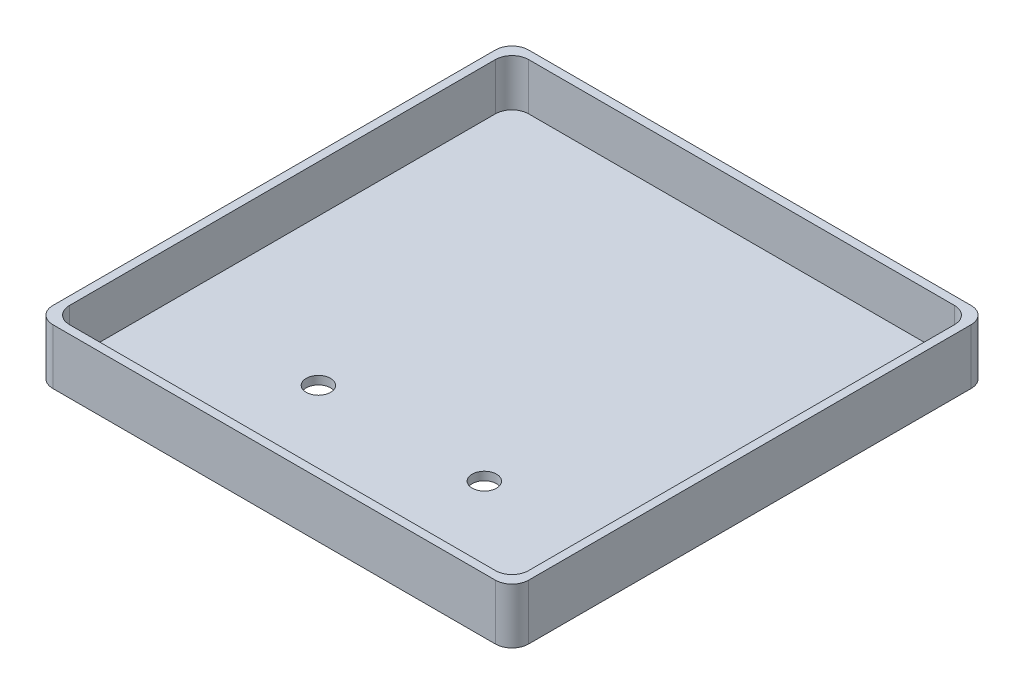
ISO-10303-21;
HEADER;
FILE_DESCRIPTION(('STEP AP214'),'2;1');
FILE_NAME('part.step','',(''),(''),'','','');
FILE_SCHEMA(('AUTOMOTIVE_DESIGN { 1 0 10303 214 1 1 1 1 }'));
ENDSEC;
DATA;
#1=APPLICATION_CONTEXT('core data for automotive mechanical design processes');
#2=APPLICATION_PROTOCOL_DEFINITION('international standard','automotive_design',2000,#1);
#3=PRODUCT_CONTEXT('',#1,'mechanical');
#4=PRODUCT('Part','Part','',(#3));
#5=PRODUCT_RELATED_PRODUCT_CATEGORY('part','',(#4));
#6=PRODUCT_DEFINITION_FORMATION('','',#4);
#7=PRODUCT_DEFINITION_CONTEXT('part definition',#1,'design');
#8=PRODUCT_DEFINITION('design','',#6,#7);
#9=PRODUCT_DEFINITION_SHAPE('','',#8);
#10=(LENGTH_UNIT() NAMED_UNIT(*) SI_UNIT(.MILLI.,.METRE.));
#11=(NAMED_UNIT(*) PLANE_ANGLE_UNIT() SI_UNIT($,.RADIAN.));
#12=(NAMED_UNIT(*) SI_UNIT($,.STERADIAN.) SOLID_ANGLE_UNIT());
#13=UNCERTAINTY_MEASURE_WITH_UNIT(LENGTH_MEASURE(1.E-05),#10,'distance_accuracy_value','');
#14=(GEOMETRIC_REPRESENTATION_CONTEXT(3) GLOBAL_UNCERTAINTY_ASSIGNED_CONTEXT((#13)) GLOBAL_UNIT_ASSIGNED_CONTEXT((#10,
#11,#12)) REPRESENTATION_CONTEXT('',''));
#15=CARTESIAN_POINT('',(0.,0.,0.));
#16=DIRECTION('',(0.,0.,1.));
#17=DIRECTION('',(1.,0.,0.));
#18=AXIS2_PLACEMENT_3D('',#15,#16,#17);
#19=CARTESIAN_POINT('',(-40.,10.,40.));
#20=DIRECTION('',(0.,-1.,0.));
#21=DIRECTION('',(0.,0.,-1.));
#22=AXIS2_PLACEMENT_3D('',#19,#20,#21);
#23=CYLINDRICAL_SURFACE('',#22,3.);
#24=CARTESIAN_POINT('',(-40.,0.,40.));
#25=DIRECTION('',(0.,1.,0.));
#26=DIRECTION('',(0.,0.,1.));
#27=AXIS2_PLACEMENT_3D('',#24,#25,#26);
#28=CIRCLE('',#27,3.);
#29=CARTESIAN_POINT('',(-43.,0.,40.));
#30=VERTEX_POINT('',#29);
#31=CARTESIAN_POINT('',(-40.,0.,43.));
#32=VERTEX_POINT('',#31);
#33=EDGE_CURVE('E153',#30,#32,#28,.T.);
#34=ORIENTED_EDGE('',*,*,#33,.T.);
#35=DIRECTION('',(0.,-1.,0.));
#36=VECTOR('',#35,1.);
#37=CARTESIAN_POINT('',(-40.,10.,43.));
#38=LINE('',#37,#36);
#39=CARTESIAN_POINT('',(-40.,10.,43.));
#40=VERTEX_POINT('',#39);
#41=EDGE_CURVE('E11',#40,#32,#38,.T.);
#42=ORIENTED_EDGE('',*,*,#41,.F.);
#43=CARTESIAN_POINT('',(-40.,10.,40.));
#44=DIRECTION('',(0.,1.,0.));
#45=DIRECTION('',(0.,0.,1.));
#46=AXIS2_PLACEMENT_3D('',#43,#44,#45);
#47=CIRCLE('',#46,3.);
#48=CARTESIAN_POINT('',(-43.,10.,40.));
#49=VERTEX_POINT('',#48);
#50=EDGE_CURVE('E177',#49,#40,#47,.T.);
#51=ORIENTED_EDGE('',*,*,#50,.F.);
#52=DIRECTION('',(0.,-1.,0.));
#53=VECTOR('',#52,1.);
#54=CARTESIAN_POINT('',(-43.,10.,40.));
#55=LINE('',#54,#53);
#56=EDGE_CURVE('E149',#49,#30,#55,.T.);
#57=ORIENTED_EDGE('',*,*,#56,.T.);
#58=EDGE_LOOP('',(#34,#42,#51,#57));
#59=FACE_BOUND('',#58,.T.);
#60=ADVANCED_FACE('F38',(#59),#23,.T.);
#61=CARTESIAN_POINT('',(-40.,10.,43.));
#62=DIRECTION('',(0.,0.,-1.));
#63=DIRECTION('',(-1.,0.,0.));
#64=AXIS2_PLACEMENT_3D('',#61,#62,#63);
#65=PLANE('',#64);
#66=DIRECTION('',(1.,0.,0.));
#67=VECTOR('',#66,1.);
#68=CARTESIAN_POINT('',(-40.,0.,43.));
#69=LINE('',#68,#67);
#70=CARTESIAN_POINT('',(40.,0.,43.));
#71=VERTEX_POINT('',#70);
#72=EDGE_CURVE('E157',#32,#71,#69,.T.);
#73=ORIENTED_EDGE('',*,*,#72,.T.);
#74=DIRECTION('',(0.,-1.,0.));
#75=VECTOR('',#74,1.);
#76=CARTESIAN_POINT('',(40.,10.,43.));
#77=LINE('',#76,#75);
#78=CARTESIAN_POINT('',(40.,10.,43.));
#79=VERTEX_POINT('',#78);
#80=EDGE_CURVE('E47',#79,#71,#77,.T.);
#81=ORIENTED_EDGE('',*,*,#80,.F.);
#82=DIRECTION('',(1.,0.,0.));
#83=VECTOR('',#82,1.);
#84=CARTESIAN_POINT('',(-40.,10.,43.));
#85=LINE('',#84,#83);
#86=EDGE_CURVE('E105',#40,#79,#85,.T.);
#87=ORIENTED_EDGE('',*,*,#86,.F.);
#88=ORIENTED_EDGE('',*,*,#41,.T.);
#89=EDGE_LOOP('',(#73,#81,#87,#88));
#90=FACE_BOUND('',#89,.T.);
#91=ADVANCED_FACE('F330',(#90),#65,.F.);
#92=CARTESIAN_POINT('',(40.,10.,40.));
#93=DIRECTION('',(0.,-1.,0.));
#94=DIRECTION('',(0.,0.,-1.));
#95=AXIS2_PLACEMENT_3D('',#92,#93,#94);
#96=CYLINDRICAL_SURFACE('',#95,3.);
#97=CARTESIAN_POINT('',(40.,0.,40.));
#98=DIRECTION('',(0.,1.,0.));
#99=DIRECTION('',(0.,0.,1.));
#100=AXIS2_PLACEMENT_3D('',#97,#98,#99);
#101=CIRCLE('',#100,3.);
#102=CARTESIAN_POINT('',(43.,0.,40.));
#103=VERTEX_POINT('',#102);
#104=EDGE_CURVE('E161',#71,#103,#101,.T.);
#105=ORIENTED_EDGE('',*,*,#104,.T.);
#106=DIRECTION('',(0.,-1.,0.));
#107=VECTOR('',#106,1.);
#108=CARTESIAN_POINT('',(43.,10.,40.));
#109=LINE('',#108,#107);
#110=CARTESIAN_POINT('',(43.,10.,40.));
#111=VERTEX_POINT('',#110);
#112=EDGE_CURVE('E188',#111,#103,#109,.T.);
#113=ORIENTED_EDGE('',*,*,#112,.F.);
#114=CARTESIAN_POINT('',(40.,10.,40.));
#115=DIRECTION('',(0.,1.,0.));
#116=DIRECTION('',(0.,0.,1.));
#117=AXIS2_PLACEMENT_3D('',#114,#115,#116);
#118=CIRCLE('',#117,3.);
#119=EDGE_CURVE('E307',#79,#111,#118,.T.);
#120=ORIENTED_EDGE('',*,*,#119,.F.);
#121=ORIENTED_EDGE('',*,*,#80,.T.);
#122=EDGE_LOOP('',(#105,#113,#120,#121));
#123=FACE_BOUND('',#122,.T.);
#124=ADVANCED_FACE('F333',(#123),#96,.T.);
#125=CARTESIAN_POINT('',(43.,10.,-40.));
#126=DIRECTION('',(-1.,0.,0.));
#127=DIRECTION('',(0.,0.,1.));
#128=AXIS2_PLACEMENT_3D('',#125,#126,#127);
#129=PLANE('',#128);
#130=DIRECTION('',(0.,0.,-1.));
#131=VECTOR('',#130,1.);
#132=CARTESIAN_POINT('',(43.,0.,-40.));
#133=LINE('',#132,#131);
#134=CARTESIAN_POINT('',(43.,0.,-40.));
#135=VERTEX_POINT('',#134);
#136=EDGE_CURVE('E164',#103,#135,#133,.T.);
#137=ORIENTED_EDGE('',*,*,#136,.T.);
#138=DIRECTION('',(0.,-1.,0.));
#139=VECTOR('',#138,1.);
#140=CARTESIAN_POINT('',(43.,10.,-40.));
#141=LINE('',#140,#139);
#142=CARTESIAN_POINT('',(43.,10.,-40.));
#143=VERTEX_POINT('',#142);
#144=EDGE_CURVE('E184',#143,#135,#141,.T.);
#145=ORIENTED_EDGE('',*,*,#144,.F.);
#146=DIRECTION('',(0.,0.,-1.));
#147=VECTOR('',#146,1.);
#148=CARTESIAN_POINT('',(43.,10.,-40.));
#149=LINE('',#148,#147);
#150=EDGE_CURVE('E310',#111,#143,#149,.T.);
#151=ORIENTED_EDGE('',*,*,#150,.F.);
#152=ORIENTED_EDGE('',*,*,#112,.T.);
#153=EDGE_LOOP('',(#137,#145,#151,#152));
#154=FACE_BOUND('',#153,.T.);
#155=ADVANCED_FACE('F318',(#154),#129,.F.);
#156=CARTESIAN_POINT('',(40.,10.,-40.));
#157=DIRECTION('',(0.,-1.,0.));
#158=DIRECTION('',(0.,0.,-1.));
#159=AXIS2_PLACEMENT_3D('',#156,#157,#158);
#160=CYLINDRICAL_SURFACE('',#159,3.);
#161=CARTESIAN_POINT('',(40.,0.,-40.));
#162=DIRECTION('',(0.,1.,0.));
#163=DIRECTION('',(0.,0.,-1.));
#164=AXIS2_PLACEMENT_3D('',#161,#162,#163);
#165=CIRCLE('',#164,3.);
#166=CARTESIAN_POINT('',(40.,0.,-43.));
#167=VERTEX_POINT('',#166);
#168=EDGE_CURVE('E167',#135,#167,#165,.T.);
#169=ORIENTED_EDGE('',*,*,#168,.T.);
#170=DIRECTION('',(0.,-1.,0.));
#171=VECTOR('',#170,1.);
#172=CARTESIAN_POINT('',(40.,10.,-43.));
#173=LINE('',#172,#171);
#174=CARTESIAN_POINT('',(40.,10.,-43.));
#175=VERTEX_POINT('',#174);
#176=EDGE_CURVE('E142',#175,#167,#173,.T.);
#177=ORIENTED_EDGE('',*,*,#176,.F.);
#178=CARTESIAN_POINT('',(40.,10.,-40.));
#179=DIRECTION('',(0.,1.,0.));
#180=DIRECTION('',(0.,0.,-1.));
#181=AXIS2_PLACEMENT_3D('',#178,#179,#180);
#182=CIRCLE('',#181,3.);
#183=EDGE_CURVE('E128',#143,#175,#182,.T.);
#184=ORIENTED_EDGE('',*,*,#183,.F.);
#185=ORIENTED_EDGE('',*,*,#144,.T.);
#186=EDGE_LOOP('',(#169,#177,#184,#185));
#187=FACE_BOUND('',#186,.T.);
#188=ADVANCED_FACE('F322',(#187),#160,.T.);
#189=CARTESIAN_POINT('',(-40.,10.,-43.));
#190=DIRECTION('',(0.,0.,1.));
#191=DIRECTION('',(1.,0.,0.));
#192=AXIS2_PLACEMENT_3D('',#189,#190,#191);
#193=PLANE('',#192);
#194=DIRECTION('',(-1.,0.,0.));
#195=VECTOR('',#194,1.);
#196=CARTESIAN_POINT('',(-40.,0.,-43.));
#197=LINE('',#196,#195);
#198=CARTESIAN_POINT('',(-40.,0.,-43.));
#199=VERTEX_POINT('',#198);
#200=EDGE_CURVE('E138',#167,#199,#197,.T.);
#201=ORIENTED_EDGE('',*,*,#200,.T.);
#202=DIRECTION('',(0.,-1.,0.));
#203=VECTOR('',#202,1.);
#204=CARTESIAN_POINT('',(-40.,10.,-43.));
#205=LINE('',#204,#203);
#206=CARTESIAN_POINT('',(-40.,10.,-43.));
#207=VERTEX_POINT('',#206);
#208=EDGE_CURVE('E135',#207,#199,#205,.T.);
#209=ORIENTED_EDGE('',*,*,#208,.F.);
#210=DIRECTION('',(-1.,0.,0.));
#211=VECTOR('',#210,1.);
#212=CARTESIAN_POINT('',(-40.,10.,-43.));
#213=LINE('',#212,#211);
#214=EDGE_CURVE('E121',#175,#207,#213,.T.);
#215=ORIENTED_EDGE('',*,*,#214,.F.);
#216=ORIENTED_EDGE('',*,*,#176,.T.);
#217=EDGE_LOOP('',(#201,#209,#215,#216));
#218=FACE_BOUND('',#217,.T.);
#219=ADVANCED_FACE('F136',(#218),#193,.F.);
#220=CARTESIAN_POINT('',(-40.,10.,-40.));
#221=DIRECTION('',(0.,-1.,0.));
#222=DIRECTION('',(0.,0.,-1.));
#223=AXIS2_PLACEMENT_3D('',#220,#221,#222);
#224=CYLINDRICAL_SURFACE('',#223,3.);
#225=CARTESIAN_POINT('',(-40.,0.,-40.));
#226=DIRECTION('',(0.,1.,0.));
#227=DIRECTION('',(0.,0.,1.));
#228=AXIS2_PLACEMENT_3D('',#225,#226,#227);
#229=CIRCLE('',#228,3.);
#230=CARTESIAN_POINT('',(-43.,0.,-40.));
#231=VERTEX_POINT('',#230);
#232=EDGE_CURVE('E172',#199,#231,#229,.T.);
#233=ORIENTED_EDGE('',*,*,#232,.T.);
#234=DIRECTION('',(0.,-1.,0.));
#235=VECTOR('',#234,1.);
#236=CARTESIAN_POINT('',(-43.,10.,-40.));
#237=LINE('',#236,#235);
#238=CARTESIAN_POINT('',(-43.,10.,-40.));
#239=VERTEX_POINT('',#238);
#240=EDGE_CURVE('E143',#239,#231,#237,.T.);
#241=ORIENTED_EDGE('',*,*,#240,.F.);
#242=CARTESIAN_POINT('',(-40.,10.,-40.));
#243=DIRECTION('',(0.,1.,0.));
#244=DIRECTION('',(0.,0.,1.));
#245=AXIS2_PLACEMENT_3D('',#242,#243,#244);
#246=CIRCLE('',#245,3.);
#247=EDGE_CURVE('E125',#207,#239,#246,.T.);
#248=ORIENTED_EDGE('',*,*,#247,.F.);
#249=ORIENTED_EDGE('',*,*,#208,.T.);
#250=EDGE_LOOP('',(#233,#241,#248,#249));
#251=FACE_BOUND('',#250,.T.);
#252=ADVANCED_FACE('F145',(#251),#224,.T.);
#253=CARTESIAN_POINT('',(-43.,10.,-40.));
#254=DIRECTION('',(1.,0.,0.));
#255=DIRECTION('',(0.,0.,-1.));
#256=AXIS2_PLACEMENT_3D('',#253,#254,#255);
#257=PLANE('',#256);
#258=DIRECTION('',(0.,0.,1.));
#259=VECTOR('',#258,1.);
#260=CARTESIAN_POINT('',(-43.,0.,-40.));
#261=LINE('',#260,#259);
#262=EDGE_CURVE('E97',#231,#30,#261,.T.);
#263=ORIENTED_EDGE('',*,*,#262,.T.);
#264=ORIENTED_EDGE('',*,*,#56,.F.);
#265=DIRECTION('',(0.,0.,1.));
#266=VECTOR('',#265,1.);
#267=CARTESIAN_POINT('',(-43.,10.,-40.));
#268=LINE('',#267,#266);
#269=EDGE_CURVE('E64',#239,#49,#268,.T.);
#270=ORIENTED_EDGE('',*,*,#269,.F.);
#271=ORIENTED_EDGE('',*,*,#240,.T.);
#272=EDGE_LOOP('',(#263,#264,#270,#271));
#273=FACE_BOUND('',#272,.T.);
#274=ADVANCED_FACE('F326',(#273),#257,.F.);
#275=CARTESIAN_POINT('',(-40.,10.,40.));
#276=DIRECTION('',(0.,1.,0.));
#277=DIRECTION('',(0.,0.,1.));
#278=AXIS2_PLACEMENT_3D('',#275,#276,#277);
#279=PLANE('',#278);
#280=CARTESIAN_POINT('',(-38.5,10.,38.5));
#281=DIRECTION('',(0.,1.,0.));
#282=DIRECTION('',(0.,0.,-1.));
#283=AXIS2_PLACEMENT_3D('',#280,#281,#282);
#284=CIRCLE('',#283,3.);
#285=CARTESIAN_POINT('',(-41.5,10.,38.5));
#286=VERTEX_POINT('',#285);
#287=CARTESIAN_POINT('',(-38.5,10.,41.5));
#288=VERTEX_POINT('',#287);
#289=EDGE_CURVE('E55',#286,#288,#284,.T.);
#290=ORIENTED_EDGE('',*,*,#289,.F.);
#291=DIRECTION('',(0.,0.,1.));
#292=VECTOR('',#291,1.);
#293=CARTESIAN_POINT('',(-41.5,10.,38.5));
#294=LINE('',#293,#292);
#295=CARTESIAN_POINT('',(-41.5,10.,-38.5));
#296=VERTEX_POINT('',#295);
#297=EDGE_CURVE('E217',#296,#286,#294,.T.);
#298=ORIENTED_EDGE('',*,*,#297,.F.);
#299=CARTESIAN_POINT('',(-38.5,10.,-38.5));
#300=DIRECTION('',(0.,1.,0.));
#301=DIRECTION('',(0.,0.,-1.));
#302=AXIS2_PLACEMENT_3D('',#299,#300,#301);
#303=CIRCLE('',#302,3.);
#304=CARTESIAN_POINT('',(-38.5,10.,-41.5));
#305=VERTEX_POINT('',#304);
#306=EDGE_CURVE('E268',#305,#296,#303,.T.);
#307=ORIENTED_EDGE('',*,*,#306,.F.);
#308=DIRECTION('',(-1.,0.,0.));
#309=VECTOR('',#308,1.);
#310=CARTESIAN_POINT('',(-38.5,10.,-41.5));
#311=LINE('',#310,#309);
#312=CARTESIAN_POINT('',(38.5,10.,-41.5));
#313=VERTEX_POINT('',#312);
#314=EDGE_CURVE('E264',#313,#305,#311,.T.);
#315=ORIENTED_EDGE('',*,*,#314,.F.);
#316=CARTESIAN_POINT('',(38.5,10.,-38.5));
#317=DIRECTION('',(0.,1.,0.));
#318=DIRECTION('',(0.,0.,-1.));
#319=AXIS2_PLACEMENT_3D('',#316,#317,#318);
#320=CIRCLE('',#319,3.);
#321=CARTESIAN_POINT('',(41.5,10.,-38.5));
#322=VERTEX_POINT('',#321);
#323=EDGE_CURVE('E260',#322,#313,#320,.T.);
#324=ORIENTED_EDGE('',*,*,#323,.F.);
#325=DIRECTION('',(0.,0.,-1.));
#326=VECTOR('',#325,1.);
#327=CARTESIAN_POINT('',(41.5,10.,38.5));
#328=LINE('',#327,#326);
#329=CARTESIAN_POINT('',(41.5,10.,38.5));
#330=VERTEX_POINT('',#329);
#331=EDGE_CURVE('E256',#330,#322,#328,.T.);
#332=ORIENTED_EDGE('',*,*,#331,.F.);
#333=CARTESIAN_POINT('',(38.5,10.,38.5));
#334=DIRECTION('',(0.,1.,0.));
#335=DIRECTION('',(0.,0.,1.));
#336=AXIS2_PLACEMENT_3D('',#333,#334,#335);
#337=CIRCLE('',#336,3.);
#338=CARTESIAN_POINT('',(38.5,10.,41.5));
#339=VERTEX_POINT('',#338);
#340=EDGE_CURVE('E252',#339,#330,#337,.T.);
#341=ORIENTED_EDGE('',*,*,#340,.F.);
#342=DIRECTION('',(1.,0.,0.));
#343=VECTOR('',#342,1.);
#344=CARTESIAN_POINT('',(-38.5,10.,41.5));
#345=LINE('',#344,#343);
#346=EDGE_CURVE('E248',#288,#339,#345,.T.);
#347=ORIENTED_EDGE('',*,*,#346,.F.);
#348=EDGE_LOOP('',(#290,#298,#307,#315,#324,#332,#341,#347));
#349=FACE_BOUND('',#348,.T.);
#350=ORIENTED_EDGE('',*,*,#50,.T.);
#351=ORIENTED_EDGE('',*,*,#86,.T.);
#352=ORIENTED_EDGE('',*,*,#119,.T.);
#353=ORIENTED_EDGE('',*,*,#150,.T.);
#354=ORIENTED_EDGE('',*,*,#183,.T.);
#355=ORIENTED_EDGE('',*,*,#214,.T.);
#356=ORIENTED_EDGE('',*,*,#247,.T.);
#357=ORIENTED_EDGE('',*,*,#269,.T.);
#358=EDGE_LOOP('',(#350,#351,#352,#353,#354,#355,#356,#357));
#359=FACE_BOUND('',#358,.T.);
#360=ADVANCED_FACE('F123',(#349,#359),#279,.T.);
#361=CARTESIAN_POINT('',(-40.,0.,40.));
#362=DIRECTION('',(0.,1.,0.));
#363=DIRECTION('',(0.,0.,1.));
#364=AXIS2_PLACEMENT_3D('',#361,#362,#363);
#365=PLANE('',#364);
#366=CARTESIAN_POINT('',(-15.,0.,20.));
#367=DIRECTION('',(0.,-1.,0.));
#368=DIRECTION('',(0.,0.,-1.));
#369=AXIS2_PLACEMENT_3D('',#366,#367,#368);
#370=CIRCLE('',#369,2.2);
#371=CARTESIAN_POINT('',(-15.,0.,17.8));
#372=VERTEX_POINT('',#371);
#373=EDGE_CURVE('E197',#372,#372,#370,.T.);
#374=ORIENTED_EDGE('',*,*,#373,.F.);
#375=EDGE_LOOP('',(#374));
#376=FACE_BOUND('',#375,.T.);
#377=CARTESIAN_POINT('',(15.,0.,20.));
#378=DIRECTION('',(0.,-1.,0.));
#379=DIRECTION('',(0.,0.,1.));
#380=AXIS2_PLACEMENT_3D('',#377,#378,#379);
#381=CIRCLE('',#380,2.2);
#382=CARTESIAN_POINT('',(15.,0.,22.2));
#383=VERTEX_POINT('',#382);
#384=EDGE_CURVE('E204',#383,#383,#381,.T.);
#385=ORIENTED_EDGE('',*,*,#384,.F.);
#386=EDGE_LOOP('',(#385));
#387=FACE_BOUND('',#386,.T.);
#388=ORIENTED_EDGE('',*,*,#33,.F.);
#389=ORIENTED_EDGE('',*,*,#262,.F.);
#390=ORIENTED_EDGE('',*,*,#232,.F.);
#391=ORIENTED_EDGE('',*,*,#200,.F.);
#392=ORIENTED_EDGE('',*,*,#168,.F.);
#393=ORIENTED_EDGE('',*,*,#136,.F.);
#394=ORIENTED_EDGE('',*,*,#104,.F.);
#395=ORIENTED_EDGE('',*,*,#72,.F.);
#396=EDGE_LOOP('',(#388,#389,#390,#391,#392,#393,#394,#395));
#397=FACE_BOUND('',#396,.T.);
#398=ADVANCED_FACE('F325',(#376,#387,#397),#365,.F.);
#399=CARTESIAN_POINT('',(-38.5,1.5,38.5));
#400=DIRECTION('',(0.,1.,0.));
#401=DIRECTION('',(0.,0.,1.));
#402=AXIS2_PLACEMENT_3D('',#399,#400,#401);
#403=CYLINDRICAL_SURFACE('',#402,3.);
#404=ORIENTED_EDGE('',*,*,#289,.T.);
#405=DIRECTION('',(0.,1.,0.));
#406=VECTOR('',#405,1.);
#407=CARTESIAN_POINT('',(-38.5,1.5,41.5));
#408=LINE('',#407,#406);
#409=CARTESIAN_POINT('',(-38.5,1.5,41.5));
#410=VERTEX_POINT('',#409);
#411=EDGE_CURVE('E245',#410,#288,#408,.T.);
#412=ORIENTED_EDGE('',*,*,#411,.F.);
#413=CARTESIAN_POINT('',(-38.5,1.5,38.5));
#414=DIRECTION('',(0.,1.,0.));
#415=DIRECTION('',(0.,0.,-1.));
#416=AXIS2_PLACEMENT_3D('',#413,#414,#415);
#417=CIRCLE('',#416,3.);
#418=CARTESIAN_POINT('',(-41.5,1.5,38.5));
#419=VERTEX_POINT('',#418);
#420=EDGE_CURVE('E212',#419,#410,#417,.T.);
#421=ORIENTED_EDGE('',*,*,#420,.F.);
#422=DIRECTION('',(0.,1.,0.));
#423=VECTOR('',#422,1.);
#424=CARTESIAN_POINT('',(-41.5,1.5,38.5));
#425=LINE('',#424,#423);
#426=EDGE_CURVE('E158',#419,#286,#425,.T.);
#427=ORIENTED_EDGE('',*,*,#426,.T.);
#428=EDGE_LOOP('',(#404,#412,#421,#427));
#429=FACE_BOUND('',#428,.T.);
#430=ADVANCED_FACE('F406',(#429),#403,.F.);
#431=CARTESIAN_POINT('',(-41.5,1.5,38.5));
#432=DIRECTION('',(-1.,0.,0.));
#433=DIRECTION('',(0.,0.,1.));
#434=AXIS2_PLACEMENT_3D('',#431,#432,#433);
#435=PLANE('',#434);
#436=ORIENTED_EDGE('',*,*,#297,.T.);
#437=ORIENTED_EDGE('',*,*,#426,.F.);
#438=DIRECTION('',(0.,0.,1.));
#439=VECTOR('',#438,1.);
#440=CARTESIAN_POINT('',(-41.5,1.5,38.5));
#441=LINE('',#440,#439);
#442=CARTESIAN_POINT('',(-41.5,1.5,-38.5));
#443=VERTEX_POINT('',#442);
#444=EDGE_CURVE('E241',#443,#419,#441,.T.);
#445=ORIENTED_EDGE('',*,*,#444,.F.);
#446=DIRECTION('',(0.,1.,0.));
#447=VECTOR('',#446,1.);
#448=CARTESIAN_POINT('',(-41.5,1.5,-38.5));
#449=LINE('',#448,#447);
#450=EDGE_CURVE('E277',#443,#296,#449,.T.);
#451=ORIENTED_EDGE('',*,*,#450,.T.);
#452=EDGE_LOOP('',(#436,#437,#445,#451));
#453=FACE_BOUND('',#452,.T.);
#454=ADVANCED_FACE('F411',(#453),#435,.F.);
#455=CARTESIAN_POINT('',(-38.5,1.5,-38.5));
#456=DIRECTION('',(0.,1.,0.));
#457=DIRECTION('',(0.,0.,1.));
#458=AXIS2_PLACEMENT_3D('',#455,#456,#457);
#459=CYLINDRICAL_SURFACE('',#458,3.);
#460=ORIENTED_EDGE('',*,*,#306,.T.);
#461=ORIENTED_EDGE('',*,*,#450,.F.);
#462=CARTESIAN_POINT('',(-38.5,1.5,-38.5));
#463=DIRECTION('',(0.,1.,0.));
#464=DIRECTION('',(0.,0.,-1.));
#465=AXIS2_PLACEMENT_3D('',#462,#463,#464);
#466=CIRCLE('',#465,3.);
#467=CARTESIAN_POINT('',(-38.5,1.5,-41.5));
#468=VERTEX_POINT('',#467);
#469=EDGE_CURVE('E237',#468,#443,#466,.T.);
#470=ORIENTED_EDGE('',*,*,#469,.F.);
#471=DIRECTION('',(0.,1.,0.));
#472=VECTOR('',#471,1.);
#473=CARTESIAN_POINT('',(-38.5,1.5,-41.5));
#474=LINE('',#473,#472);
#475=EDGE_CURVE('E281',#468,#305,#474,.T.);
#476=ORIENTED_EDGE('',*,*,#475,.T.);
#477=EDGE_LOOP('',(#460,#461,#470,#476));
#478=FACE_BOUND('',#477,.T.);
#479=ADVANCED_FACE('F420',(#478),#459,.F.);
#480=CARTESIAN_POINT('',(-38.5,1.5,-41.5));
#481=DIRECTION('',(0.,0.,-1.));
#482=DIRECTION('',(-1.,0.,0.));
#483=AXIS2_PLACEMENT_3D('',#480,#481,#482);
#484=PLANE('',#483);
#485=ORIENTED_EDGE('',*,*,#314,.T.);
#486=ORIENTED_EDGE('',*,*,#475,.F.);
#487=DIRECTION('',(-1.,0.,0.));
#488=VECTOR('',#487,1.);
#489=CARTESIAN_POINT('',(-38.5,1.5,-41.5));
#490=LINE('',#489,#488);
#491=CARTESIAN_POINT('',(38.5,1.5,-41.5));
#492=VERTEX_POINT('',#491);
#493=EDGE_CURVE('E233',#492,#468,#490,.T.);
#494=ORIENTED_EDGE('',*,*,#493,.F.);
#495=DIRECTION('',(0.,1.,0.));
#496=VECTOR('',#495,1.);
#497=CARTESIAN_POINT('',(38.5,1.5,-41.5));
#498=LINE('',#497,#496);
#499=EDGE_CURVE('E285',#492,#313,#498,.T.);
#500=ORIENTED_EDGE('',*,*,#499,.T.);
#501=EDGE_LOOP('',(#485,#486,#494,#500));
#502=FACE_BOUND('',#501,.T.);
#503=ADVANCED_FACE('F430',(#502),#484,.F.);
#504=CARTESIAN_POINT('',(38.5,1.5,-38.5));
#505=DIRECTION('',(0.,1.,0.));
#506=DIRECTION('',(0.,0.,1.));
#507=AXIS2_PLACEMENT_3D('',#504,#505,#506);
#508=CYLINDRICAL_SURFACE('',#507,3.);
#509=ORIENTED_EDGE('',*,*,#323,.T.);
#510=ORIENTED_EDGE('',*,*,#499,.F.);
#511=CARTESIAN_POINT('',(38.5,1.5,-38.5));
#512=DIRECTION('',(0.,1.,0.));
#513=DIRECTION('',(0.,0.,-1.));
#514=AXIS2_PLACEMENT_3D('',#511,#512,#513);
#515=CIRCLE('',#514,3.);
#516=CARTESIAN_POINT('',(41.5,1.5,-38.5));
#517=VERTEX_POINT('',#516);
#518=EDGE_CURVE('E229',#517,#492,#515,.T.);
#519=ORIENTED_EDGE('',*,*,#518,.F.);
#520=DIRECTION('',(0.,1.,0.));
#521=VECTOR('',#520,1.);
#522=CARTESIAN_POINT('',(41.5,1.5,-38.5));
#523=LINE('',#522,#521);
#524=EDGE_CURVE('E289',#517,#322,#523,.T.);
#525=ORIENTED_EDGE('',*,*,#524,.T.);
#526=EDGE_LOOP('',(#509,#510,#519,#525));
#527=FACE_BOUND('',#526,.T.);
#528=ADVANCED_FACE('F440',(#527),#508,.F.);
#529=CARTESIAN_POINT('',(41.5,1.5,38.5));
#530=DIRECTION('',(1.,0.,0.));
#531=DIRECTION('',(0.,0.,-1.));
#532=AXIS2_PLACEMENT_3D('',#529,#530,#531);
#533=PLANE('',#532);
#534=ORIENTED_EDGE('',*,*,#331,.T.);
#535=ORIENTED_EDGE('',*,*,#524,.F.);
#536=DIRECTION('',(0.,0.,-1.));
#537=VECTOR('',#536,1.);
#538=CARTESIAN_POINT('',(41.5,1.5,38.5));
#539=LINE('',#538,#537);
#540=CARTESIAN_POINT('',(41.5,1.5,38.5));
#541=VERTEX_POINT('',#540);
#542=EDGE_CURVE('E225',#541,#517,#539,.T.);
#543=ORIENTED_EDGE('',*,*,#542,.F.);
#544=DIRECTION('',(0.,1.,0.));
#545=VECTOR('',#544,1.);
#546=CARTESIAN_POINT('',(41.5,1.5,38.5));
#547=LINE('',#546,#545);
#548=EDGE_CURVE('E293',#541,#330,#547,.T.);
#549=ORIENTED_EDGE('',*,*,#548,.T.);
#550=EDGE_LOOP('',(#534,#535,#543,#549));
#551=FACE_BOUND('',#550,.T.);
#552=ADVANCED_FACE('F450',(#551),#533,.F.);
#553=CARTESIAN_POINT('',(38.5,1.5,38.5));
#554=DIRECTION('',(0.,1.,0.));
#555=DIRECTION('',(0.,0.,1.));
#556=AXIS2_PLACEMENT_3D('',#553,#554,#555);
#557=CYLINDRICAL_SURFACE('',#556,3.);
#558=ORIENTED_EDGE('',*,*,#340,.T.);
#559=ORIENTED_EDGE('',*,*,#548,.F.);
#560=CARTESIAN_POINT('',(38.5,1.5,38.5));
#561=DIRECTION('',(0.,1.,0.));
#562=DIRECTION('',(0.,0.,1.));
#563=AXIS2_PLACEMENT_3D('',#560,#561,#562);
#564=CIRCLE('',#563,3.);
#565=CARTESIAN_POINT('',(38.5,1.5,41.5));
#566=VERTEX_POINT('',#565);
#567=EDGE_CURVE('E221',#566,#541,#564,.T.);
#568=ORIENTED_EDGE('',*,*,#567,.F.);
#569=DIRECTION('',(0.,1.,0.));
#570=VECTOR('',#569,1.);
#571=CARTESIAN_POINT('',(38.5,1.5,41.5));
#572=LINE('',#571,#570);
#573=EDGE_CURVE('E297',#566,#339,#572,.T.);
#574=ORIENTED_EDGE('',*,*,#573,.T.);
#575=EDGE_LOOP('',(#558,#559,#568,#574));
#576=FACE_BOUND('',#575,.T.);
#577=ADVANCED_FACE('F460',(#576),#557,.F.);
#578=CARTESIAN_POINT('',(-38.5,1.5,41.5));
#579=DIRECTION('',(0.,0.,1.));
#580=DIRECTION('',(1.,0.,0.));
#581=AXIS2_PLACEMENT_3D('',#578,#579,#580);
#582=PLANE('',#581);
#583=ORIENTED_EDGE('',*,*,#346,.T.);
#584=ORIENTED_EDGE('',*,*,#573,.F.);
#585=DIRECTION('',(1.,0.,0.));
#586=VECTOR('',#585,1.);
#587=CARTESIAN_POINT('',(-38.5,1.5,41.5));
#588=LINE('',#587,#586);
#589=EDGE_CURVE('E216',#410,#566,#588,.T.);
#590=ORIENTED_EDGE('',*,*,#589,.F.);
#591=ORIENTED_EDGE('',*,*,#411,.T.);
#592=EDGE_LOOP('',(#583,#584,#590,#591));
#593=FACE_BOUND('',#592,.T.);
#594=ADVANCED_FACE('F470',(#593),#582,.F.);
#595=CARTESIAN_POINT('',(-38.5,1.5,38.5));
#596=DIRECTION('',(0.,-1.,0.));
#597=DIRECTION('',(0.,0.,-1.));
#598=AXIS2_PLACEMENT_3D('',#595,#596,#597);
#599=PLANE('',#598);
#600=CARTESIAN_POINT('',(-15.,1.5,20.));
#601=DIRECTION('',(0.,-1.,0.));
#602=DIRECTION('',(0.,0.,-1.));
#603=AXIS2_PLACEMENT_3D('',#600,#601,#602);
#604=CIRCLE('',#603,2.2);
#605=CARTESIAN_POINT('',(-15.,1.5,17.8));
#606=VERTEX_POINT('',#605);
#607=EDGE_CURVE('E41',#606,#606,#604,.T.);
#608=ORIENTED_EDGE('',*,*,#607,.T.);
#609=EDGE_LOOP('',(#608));
#610=FACE_BOUND('',#609,.T.);
#611=CARTESIAN_POINT('',(15.,1.5,20.));
#612=DIRECTION('',(0.,-1.,0.));
#613=DIRECTION('',(0.,0.,-1.));
#614=AXIS2_PLACEMENT_3D('',#611,#612,#613);
#615=CIRCLE('',#614,2.2);
#616=CARTESIAN_POINT('',(15.,1.5,17.8));
#617=VERTEX_POINT('',#616);
#618=EDGE_CURVE('E194',#617,#617,#615,.T.);
#619=ORIENTED_EDGE('',*,*,#618,.T.);
#620=EDGE_LOOP('',(#619));
#621=FACE_BOUND('',#620,.T.);
#622=ORIENTED_EDGE('',*,*,#420,.T.);
#623=ORIENTED_EDGE('',*,*,#589,.T.);
#624=ORIENTED_EDGE('',*,*,#567,.T.);
#625=ORIENTED_EDGE('',*,*,#542,.T.);
#626=ORIENTED_EDGE('',*,*,#518,.T.);
#627=ORIENTED_EDGE('',*,*,#493,.T.);
#628=ORIENTED_EDGE('',*,*,#469,.T.);
#629=ORIENTED_EDGE('',*,*,#444,.T.);
#630=EDGE_LOOP('',(#622,#623,#624,#625,#626,#627,#628,#629));
#631=FACE_BOUND('',#630,.T.);
#632=ADVANCED_FACE('F480',(#610,#621,#631),#599,.F.);
#633=CARTESIAN_POINT('',(15.,10.,20.));
#634=DIRECTION('',(0.,-1.,0.));
#635=DIRECTION('',(0.,0.,-1.));
#636=AXIS2_PLACEMENT_3D('',#633,#634,#635);
#637=CYLINDRICAL_SURFACE('',#636,2.2);
#638=ORIENTED_EDGE('',*,*,#384,.T.);
#639=EDGE_LOOP('',(#638));
#640=FACE_BOUND('',#639,.T.);
#641=ORIENTED_EDGE('',*,*,#618,.F.);
#642=EDGE_LOOP('',(#641));
#643=FACE_BOUND('',#642,.T.);
#644=ADVANCED_FACE('F495',(#640,#643),#637,.F.);
#645=CARTESIAN_POINT('',(-15.,10.,20.));
#646=DIRECTION('',(0.,-1.,0.));
#647=DIRECTION('',(0.,0.,-1.));
#648=AXIS2_PLACEMENT_3D('',#645,#646,#647);
#649=CYLINDRICAL_SURFACE('',#648,2.2);
#650=ORIENTED_EDGE('',*,*,#373,.T.);
#651=EDGE_LOOP('',(#650));
#652=FACE_BOUND('',#651,.T.);
#653=ORIENTED_EDGE('',*,*,#607,.F.);
#654=EDGE_LOOP('',(#653));
#655=FACE_BOUND('',#654,.T.);
#656=ADVANCED_FACE('F503',(#652,#655),#649,.F.);
#657=CLOSED_SHELL('',(#60,#91,#124,#155,#188,#219,#252,#274,#360,#398,#430,#454,#479,#503,#528,
#552,#577,#594,#632,#644,#656));
#658=MANIFOLD_SOLID_BREP('B2',#657);
#659=ADVANCED_BREP_SHAPE_REPRESENTATION('',(#18,#658),#14);
#660=SHAPE_DEFINITION_REPRESENTATION(#9,#659);
ENDSEC;
END-ISO-10303-21;
